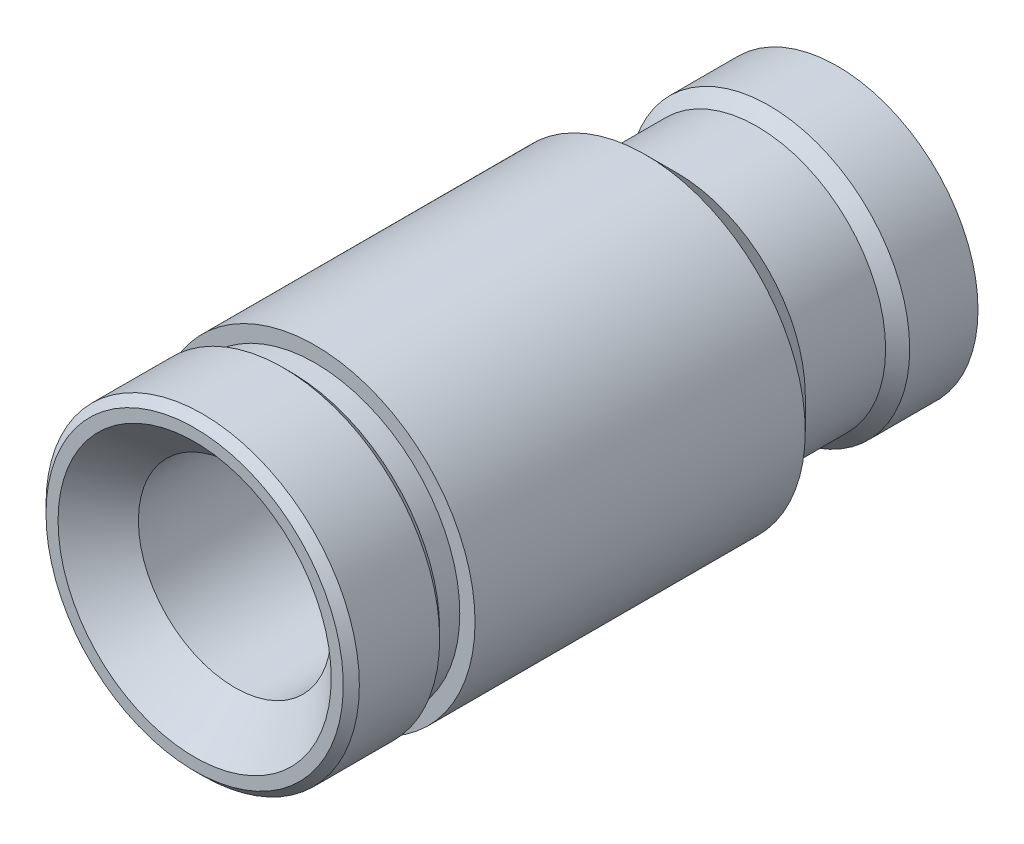
ISO-10303-21;
HEADER;
FILE_DESCRIPTION(('STEP AP214'),'2;1');
FILE_NAME('part.step','',(''),(''),'','','');
FILE_SCHEMA(('AUTOMOTIVE_DESIGN { 1 0 10303 214 1 1 1 1 }'));
ENDSEC;
DATA;
#1=APPLICATION_CONTEXT('core data for automotive mechanical design processes');
#2=APPLICATION_PROTOCOL_DEFINITION('international standard','automotive_design',2000,#1);
#3=PRODUCT_CONTEXT('',#1,'mechanical');
#4=PRODUCT('Part','Part','',(#3));
#5=PRODUCT_RELATED_PRODUCT_CATEGORY('part','',(#4));
#6=PRODUCT_DEFINITION_FORMATION('','',#4);
#7=PRODUCT_DEFINITION_CONTEXT('part definition',#1,'design');
#8=PRODUCT_DEFINITION('design','',#6,#7);
#9=PRODUCT_DEFINITION_SHAPE('','',#8);
#10=(LENGTH_UNIT() NAMED_UNIT(*) SI_UNIT(.MILLI.,.METRE.));
#11=(NAMED_UNIT(*) PLANE_ANGLE_UNIT() SI_UNIT($,.RADIAN.));
#12=(NAMED_UNIT(*) SI_UNIT($,.STERADIAN.) SOLID_ANGLE_UNIT());
#13=UNCERTAINTY_MEASURE_WITH_UNIT(LENGTH_MEASURE(1.E-05),#10,'distance_accuracy_value','');
#14=(GEOMETRIC_REPRESENTATION_CONTEXT(3) GLOBAL_UNCERTAINTY_ASSIGNED_CONTEXT((#13)) GLOBAL_UNIT_ASSIGNED_CONTEXT((#10,
#11,#12)) REPRESENTATION_CONTEXT('',''));
#15=CARTESIAN_POINT('',(0.,0.,0.));
#16=DIRECTION('',(0.,0.,1.));
#17=DIRECTION('',(1.,0.,0.));
#18=AXIS2_PLACEMENT_3D('',#15,#16,#17);
#19=CARTESIAN_POINT('',(0.,0.,0.));
#20=DIRECTION('',(0.,0.,1.));
#21=DIRECTION('',(1.,0.,0.));
#22=AXIS2_PLACEMENT_3D('',#19,#20,#21);
#23=CYLINDRICAL_SURFACE('',#22,19.5);
#24=CARTESIAN_POINT('',(0.,0.,-11.5));
#25=DIRECTION('',(0.,0.,1.));
#26=DIRECTION('',(1.,0.,0.));
#27=AXIS2_PLACEMENT_3D('',#24,#25,#26);
#28=CIRCLE('',#27,19.5);
#29=CARTESIAN_POINT('',(19.5,0.,-11.5));
#30=VERTEX_POINT('',#29);
#31=EDGE_CURVE('E59',#30,#30,#28,.T.);
#32=ORIENTED_EDGE('',*,*,#31,.T.);
#33=EDGE_LOOP('',(#32));
#34=FACE_BOUND('',#33,.T.);
#35=CARTESIAN_POINT('',(0.,0.,-1.5));
#36=DIRECTION('',(0.,0.,-1.));
#37=DIRECTION('',(-1.,0.,0.));
#38=AXIS2_PLACEMENT_3D('',#35,#36,#37);
#39=CIRCLE('',#38,19.5);
#40=CARTESIAN_POINT('',(-19.5,0.,-1.5));
#41=VERTEX_POINT('',#40);
#42=EDGE_CURVE('E62',#41,#41,#39,.T.);
#43=ORIENTED_EDGE('',*,*,#42,.T.);
#44=EDGE_LOOP('',(#43));
#45=FACE_BOUND('',#44,.T.);
#46=ADVANCED_FACE('F33',(#34,#45),#23,.T.);
#47=CARTESIAN_POINT('',(0.,19.5,-12.5));
#48=DIRECTION('',(0.,0.,1.));
#49=DIRECTION('',(1.,0.,0.));
#50=AXIS2_PLACEMENT_3D('',#47,#48,#49);
#51=PLANE('',#50);
#52=CARTESIAN_POINT('',(0.,0.,-12.5));
#53=DIRECTION('',(0.,0.,1.));
#54=DIRECTION('',(1.,0.,0.));
#55=AXIS2_PLACEMENT_3D('',#52,#53,#54);
#56=CIRCLE('',#55,18.5);
#57=CARTESIAN_POINT('',(18.5,0.,-12.5));
#58=VERTEX_POINT('',#57);
#59=EDGE_CURVE('E56',#58,#58,#56,.F.);
#60=ORIENTED_EDGE('',*,*,#59,.T.);
#61=EDGE_LOOP('',(#60));
#62=FACE_BOUND('',#61,.T.);
#63=CARTESIAN_POINT('',(0.,0.,-12.5));
#64=DIRECTION('',(0.,0.,1.));
#65=DIRECTION('',(1.,0.,0.));
#66=AXIS2_PLACEMENT_3D('',#63,#64,#65);
#67=CIRCLE('',#66,18.);
#68=CARTESIAN_POINT('',(18.,0.,-12.5));
#69=VERTEX_POINT('',#68);
#70=EDGE_CURVE('E65',#69,#69,#67,.T.);
#71=ORIENTED_EDGE('',*,*,#70,.T.);
#72=EDGE_LOOP('',(#71));
#73=FACE_BOUND('',#72,.T.);
#74=ADVANCED_FACE('F112',(#62,#73),#51,.F.);
#75=CARTESIAN_POINT('',(0.,0.,0.));
#76=DIRECTION('',(0.,0.,1.));
#77=DIRECTION('',(1.,0.,0.));
#78=AXIS2_PLACEMENT_3D('',#75,#76,#77);
#79=CYLINDRICAL_SURFACE('',#78,18.);
#80=ORIENTED_EDGE('',*,*,#70,.F.);
#81=EDGE_LOOP('',(#80));
#82=FACE_BOUND('',#81,.T.);
#83=CARTESIAN_POINT('',(0.,0.,-15.5));
#84=DIRECTION('',(0.,0.,1.));
#85=DIRECTION('',(1.,0.,0.));
#86=AXIS2_PLACEMENT_3D('',#83,#84,#85);
#87=CIRCLE('',#86,18.);
#88=CARTESIAN_POINT('',(18.,0.,-15.5));
#89=VERTEX_POINT('',#88);
#90=EDGE_CURVE('E68',#89,#89,#87,.T.);
#91=ORIENTED_EDGE('',*,*,#90,.T.);
#92=EDGE_LOOP('',(#91));
#93=FACE_BOUND('',#92,.T.);
#94=ADVANCED_FACE('F118',(#82,#93),#79,.T.);
#95=CARTESIAN_POINT('',(0.,18.,-15.5));
#96=DIRECTION('',(0.,0.,-1.));
#97=DIRECTION('',(-1.,0.,0.));
#98=AXIS2_PLACEMENT_3D('',#95,#96,#97);
#99=PLANE('',#98);
#100=ORIENTED_EDGE('',*,*,#90,.F.);
#101=EDGE_LOOP('',(#100));
#102=FACE_BOUND('',#101,.T.);
#103=CARTESIAN_POINT('',(0.,0.,-15.5));
#104=DIRECTION('',(0.,0.,1.));
#105=DIRECTION('',(1.,0.,0.));
#106=AXIS2_PLACEMENT_3D('',#103,#104,#105);
#107=CIRCLE('',#106,19.9);
#108=CARTESIAN_POINT('',(19.9,0.,-15.5));
#109=VERTEX_POINT('',#108);
#110=EDGE_CURVE('E71',#109,#109,#107,.T.);
#111=ORIENTED_EDGE('',*,*,#110,.T.);
#112=EDGE_LOOP('',(#111));
#113=FACE_BOUND('',#112,.T.);
#114=ADVANCED_FACE('F171',(#102,#113),#99,.F.);
#115=CARTESIAN_POINT('',(0.,0.,0.));
#116=DIRECTION('',(0.,0.,1.));
#117=DIRECTION('',(1.,0.,0.));
#118=AXIS2_PLACEMENT_3D('',#115,#116,#117);
#119=CYLINDRICAL_SURFACE('',#118,19.9);
#120=ORIENTED_EDGE('',*,*,#110,.F.);
#121=EDGE_LOOP('',(#120));
#122=FACE_BOUND('',#121,.T.);
#123=CARTESIAN_POINT('',(0.,0.,-56.6));
#124=DIRECTION('',(0.,0.,1.));
#125=DIRECTION('',(1.,0.,0.));
#126=AXIS2_PLACEMENT_3D('',#123,#124,#125);
#127=CIRCLE('',#126,19.9);
#128=CARTESIAN_POINT('',(19.9,0.,-56.6));
#129=VERTEX_POINT('',#128);
#130=EDGE_CURVE('E74',#129,#129,#127,.T.);
#131=ORIENTED_EDGE('',*,*,#130,.T.);
#132=EDGE_LOOP('',(#131));
#133=FACE_BOUND('',#132,.T.);
#134=ADVANCED_FACE('F167',(#122,#133),#119,.T.);
#135=CARTESIAN_POINT('',(0.,0.,-60.5));
#136=DIRECTION('',(0.,0.,1.));
#137=DIRECTION('',(1.,0.,0.));
#138=AXIS2_PLACEMENT_3D('',#135,#136,#137);
#139=CONICAL_SURFACE('',#138,16.,0.785398163397443);
#140=ORIENTED_EDGE('',*,*,#130,.F.);
#141=EDGE_LOOP('',(#140));
#142=FACE_BOUND('',#141,.T.);
#143=CARTESIAN_POINT('',(0.,0.,-60.5));
#144=DIRECTION('',(0.,0.,1.));
#145=DIRECTION('',(1.,0.,0.));
#146=AXIS2_PLACEMENT_3D('',#143,#144,#145);
#147=CIRCLE('',#146,16.);
#148=CARTESIAN_POINT('',(16.,0.,-60.5));
#149=VERTEX_POINT('',#148);
#150=EDGE_CURVE('E77',#149,#149,#147,.T.);
#151=ORIENTED_EDGE('',*,*,#150,.T.);
#152=EDGE_LOOP('',(#151));
#153=FACE_BOUND('',#152,.T.);
#154=ADVANCED_FACE('F163',(#142,#153),#139,.T.);
#155=CARTESIAN_POINT('',(0.,0.,0.));
#156=DIRECTION('',(0.,0.,1.));
#157=DIRECTION('',(1.,0.,0.));
#158=AXIS2_PLACEMENT_3D('',#155,#156,#157);
#159=CYLINDRICAL_SURFACE('',#158,16.);
#160=ORIENTED_EDGE('',*,*,#150,.F.);
#161=EDGE_LOOP('',(#160));
#162=FACE_BOUND('',#161,.T.);
#163=CARTESIAN_POINT('',(0.,0.,-70.5));
#164=DIRECTION('',(0.,0.,1.));
#165=DIRECTION('',(1.,0.,0.));
#166=AXIS2_PLACEMENT_3D('',#163,#164,#165);
#167=CIRCLE('',#166,16.);
#168=CARTESIAN_POINT('',(16.,0.,-70.5));
#169=VERTEX_POINT('',#168);
#170=EDGE_CURVE('E80',#169,#169,#167,.T.);
#171=ORIENTED_EDGE('',*,*,#170,.T.);
#172=EDGE_LOOP('',(#171));
#173=FACE_BOUND('',#172,.T.);
#174=ADVANCED_FACE('F155',(#162,#173),#159,.T.);
#175=CARTESIAN_POINT('',(0.,0.,-72.));
#176=DIRECTION('',(0.,0.,-1.));
#177=DIRECTION('',(-1.,0.,0.));
#178=AXIS2_PLACEMENT_3D('',#175,#176,#177);
#179=CONICAL_SURFACE('',#178,17.5,0.785398163397453);
#180=ORIENTED_EDGE('',*,*,#170,.F.);
#181=EDGE_LOOP('',(#180));
#182=FACE_BOUND('',#181,.T.);
#183=CARTESIAN_POINT('',(0.,0.,-72.));
#184=DIRECTION('',(0.,0.,1.));
#185=DIRECTION('',(1.,0.,0.));
#186=AXIS2_PLACEMENT_3D('',#183,#184,#185);
#187=CIRCLE('',#186,17.5);
#188=CARTESIAN_POINT('',(17.5,0.,-72.));
#189=VERTEX_POINT('',#188);
#190=EDGE_CURVE('E83',#189,#189,#187,.T.);
#191=ORIENTED_EDGE('',*,*,#190,.T.);
#192=EDGE_LOOP('',(#191));
#193=FACE_BOUND('',#192,.T.);
#194=ADVANCED_FACE('F149',(#182,#193),#179,.T.);
#195=CARTESIAN_POINT('',(0.,0.,0.));
#196=DIRECTION('',(0.,0.,1.));
#197=DIRECTION('',(1.,0.,0.));
#198=AXIS2_PLACEMENT_3D('',#195,#196,#197);
#199=CYLINDRICAL_SURFACE('',#198,17.5);
#200=ORIENTED_EDGE('',*,*,#190,.F.);
#201=EDGE_LOOP('',(#200));
#202=FACE_BOUND('',#201,.T.);
#203=CARTESIAN_POINT('',(0.,0.,-80.5));
#204=DIRECTION('',(0.,0.,1.));
#205=DIRECTION('',(1.,0.,0.));
#206=AXIS2_PLACEMENT_3D('',#203,#204,#205);
#207=CIRCLE('',#206,17.5);
#208=CARTESIAN_POINT('',(17.5,0.,-80.5));
#209=VERTEX_POINT('',#208);
#210=EDGE_CURVE('E86',#209,#209,#207,.T.);
#211=ORIENTED_EDGE('',*,*,#210,.T.);
#212=EDGE_LOOP('',(#211));
#213=FACE_BOUND('',#212,.T.);
#214=ADVANCED_FACE('F144',(#202,#213),#199,.T.);
#215=CARTESIAN_POINT('',(0.,11.,-80.5));
#216=DIRECTION('',(0.,0.,1.));
#217=DIRECTION('',(1.,0.,0.));
#218=AXIS2_PLACEMENT_3D('',#215,#216,#217);
#219=PLANE('',#218);
#220=CARTESIAN_POINT('',(0.,0.,-80.5));
#221=DIRECTION('',(0.,0.,1.));
#222=DIRECTION('',(1.,0.,0.));
#223=AXIS2_PLACEMENT_3D('',#220,#221,#222);
#224=CIRCLE('',#223,13.);
#225=CARTESIAN_POINT('',(13.,0.,-80.5));
#226=VERTEX_POINT('',#225);
#227=EDGE_CURVE('E48',#226,#226,#224,.T.);
#228=ORIENTED_EDGE('',*,*,#227,.T.);
#229=EDGE_LOOP('',(#228));
#230=FACE_BOUND('',#229,.T.);
#231=ORIENTED_EDGE('',*,*,#210,.F.);
#232=EDGE_LOOP('',(#231));
#233=FACE_BOUND('',#232,.T.);
#234=ADVANCED_FACE('F141',(#230,#233),#219,.F.);
#235=CARTESIAN_POINT('',(0.,0.,0.));
#236=DIRECTION('',(0.,0.,1.));
#237=DIRECTION('',(1.,0.,0.));
#238=AXIS2_PLACEMENT_3D('',#235,#236,#237);
#239=CYLINDRICAL_SURFACE('',#238,11.);
#240=CARTESIAN_POINT('',(0.,0.,-78.5));
#241=DIRECTION('',(0.,0.,1.));
#242=DIRECTION('',(1.,0.,0.));
#243=AXIS2_PLACEMENT_3D('',#240,#241,#242);
#244=CIRCLE('',#243,11.);
#245=CARTESIAN_POINT('',(11.,0.,-78.5));
#246=VERTEX_POINT('',#245);
#247=EDGE_CURVE('E44',#246,#246,#244,.F.);
#248=ORIENTED_EDGE('',*,*,#247,.T.);
#249=EDGE_LOOP('',(#248));
#250=FACE_BOUND('',#249,.T.);
#251=CARTESIAN_POINT('',(0.,0.,-63.5));
#252=DIRECTION('',(0.,0.,1.));
#253=DIRECTION('',(1.,0.,0.));
#254=AXIS2_PLACEMENT_3D('',#251,#252,#253);
#255=CIRCLE('',#254,11.);
#256=CARTESIAN_POINT('',(11.,0.,-63.5));
#257=VERTEX_POINT('',#256);
#258=EDGE_CURVE('E89',#257,#257,#255,.T.);
#259=ORIENTED_EDGE('',*,*,#258,.T.);
#260=EDGE_LOOP('',(#259));
#261=FACE_BOUND('',#260,.T.);
#262=ADVANCED_FACE('F108',(#250,#261),#239,.F.);
#263=CARTESIAN_POINT('',(0.,12.,-63.5));
#264=DIRECTION('',(0.,0.,-1.));
#265=DIRECTION('',(-1.,0.,0.));
#266=AXIS2_PLACEMENT_3D('',#263,#264,#265);
#267=PLANE('',#266);
#268=ORIENTED_EDGE('',*,*,#258,.F.);
#269=EDGE_LOOP('',(#268));
#270=FACE_BOUND('',#269,.T.);
#271=CARTESIAN_POINT('',(0.,0.,-63.5));
#272=DIRECTION('',(0.,0.,1.));
#273=DIRECTION('',(1.,0.,0.));
#274=AXIS2_PLACEMENT_3D('',#271,#272,#273);
#275=CIRCLE('',#274,12.);
#276=CARTESIAN_POINT('',(12.,0.,-63.5));
#277=VERTEX_POINT('',#276);
#278=EDGE_CURVE('E92',#277,#277,#275,.T.);
#279=ORIENTED_EDGE('',*,*,#278,.T.);
#280=EDGE_LOOP('',(#279));
#281=FACE_BOUND('',#280,.T.);
#282=ADVANCED_FACE('F96',(#270,#281),#267,.F.);
#283=CARTESIAN_POINT('',(0.,0.,0.));
#284=DIRECTION('',(0.,0.,1.));
#285=DIRECTION('',(1.,0.,0.));
#286=AXIS2_PLACEMENT_3D('',#283,#284,#285);
#287=CYLINDRICAL_SURFACE('',#286,12.);
#288=CARTESIAN_POINT('',(0.,0.,-5.49999999999999));
#289=DIRECTION('',(0.,0.,-1.));
#290=DIRECTION('',(-1.,0.,0.));
#291=AXIS2_PLACEMENT_3D('',#288,#289,#290);
#292=CIRCLE('',#291,12.);
#293=CARTESIAN_POINT('',(-12.,0.,-5.49999999999999));
#294=VERTEX_POINT('',#293);
#295=EDGE_CURVE('E40',#294,#294,#292,.F.);
#296=ORIENTED_EDGE('',*,*,#295,.T.);
#297=EDGE_LOOP('',(#296));
#298=FACE_BOUND('',#297,.T.);
#299=ORIENTED_EDGE('',*,*,#278,.F.);
#300=EDGE_LOOP('',(#299));
#301=FACE_BOUND('',#300,.T.);
#302=ADVANCED_FACE('F98',(#298,#301),#287,.F.);
#303=CARTESIAN_POINT('',(0.,12.,-0.500000000000001));
#304=DIRECTION('',(0.,0.,-1.));
#305=DIRECTION('',(-1.,0.,0.));
#306=AXIS2_PLACEMENT_3D('',#303,#304,#305);
#307=PLANE('',#306);
#308=CARTESIAN_POINT('',(0.,0.,-0.500000000000001));
#309=DIRECTION('',(0.,0.,-1.));
#310=DIRECTION('',(-1.,0.,0.));
#311=AXIS2_PLACEMENT_3D('',#308,#309,#310);
#312=CIRCLE('',#311,17.);
#313=CARTESIAN_POINT('',(-17.,0.,-0.500000000000001));
#314=VERTEX_POINT('',#313);
#315=EDGE_CURVE('E10',#314,#314,#312,.T.);
#316=ORIENTED_EDGE('',*,*,#315,.T.);
#317=EDGE_LOOP('',(#316));
#318=FACE_BOUND('',#317,.T.);
#319=CARTESIAN_POINT('',(0.,0.,-0.500000000000001));
#320=DIRECTION('',(0.,0.,-1.));
#321=DIRECTION('',(-1.,0.,0.));
#322=AXIS2_PLACEMENT_3D('',#319,#320,#321);
#323=CIRCLE('',#322,18.5);
#324=CARTESIAN_POINT('',(-18.5,0.,-0.500000000000001));
#325=VERTEX_POINT('',#324);
#326=EDGE_CURVE('E53',#325,#325,#323,.F.);
#327=ORIENTED_EDGE('',*,*,#326,.T.);
#328=EDGE_LOOP('',(#327));
#329=FACE_BOUND('',#328,.T.);
#330=ADVANCED_FACE('F100',(#318,#329),#307,.F.);
#331=CARTESIAN_POINT('',(0.,0.,-11.5));
#332=DIRECTION('',(0.,0.,1.));
#333=DIRECTION('',(1.,0.,0.));
#334=AXIS2_PLACEMENT_3D('',#331,#332,#333);
#335=CONICAL_SURFACE('',#334,19.5,0.78539816339745);
#336=ORIENTED_EDGE('',*,*,#59,.F.);
#337=EDGE_LOOP('',(#336));
#338=FACE_BOUND('',#337,.T.);
#339=ORIENTED_EDGE('',*,*,#31,.F.);
#340=EDGE_LOOP('',(#339));
#341=FACE_BOUND('',#340,.T.);
#342=ADVANCED_FACE('F106',(#338,#341),#335,.T.);
#343=CARTESIAN_POINT('',(0.,0.,-0.500000000000001));
#344=DIRECTION('',(0.,0.,-1.));
#345=DIRECTION('',(-1.,0.,0.));
#346=AXIS2_PLACEMENT_3D('',#343,#344,#345);
#347=CONICAL_SURFACE('',#346,18.5,0.785398163397457);
#348=ORIENTED_EDGE('',*,*,#42,.F.);
#349=EDGE_LOOP('',(#348));
#350=FACE_BOUND('',#349,.T.);
#351=ORIENTED_EDGE('',*,*,#326,.F.);
#352=EDGE_LOOP('',(#351));
#353=FACE_BOUND('',#352,.T.);
#354=ADVANCED_FACE('F126',(#350,#353),#347,.T.);
#355=CARTESIAN_POINT('',(0.,0.,-80.5));
#356=DIRECTION('',(0.,0.,-1.));
#357=DIRECTION('',(-1.,0.,0.));
#358=AXIS2_PLACEMENT_3D('',#355,#356,#357);
#359=CONICAL_SURFACE('',#358,13.,0.785398163397446);
#360=ORIENTED_EDGE('',*,*,#247,.F.);
#361=EDGE_LOOP('',(#360));
#362=FACE_BOUND('',#361,.T.);
#363=ORIENTED_EDGE('',*,*,#227,.F.);
#364=EDGE_LOOP('',(#363));
#365=FACE_BOUND('',#364,.T.);
#366=ADVANCED_FACE('F129',(#362,#365),#359,.F.);
#367=CARTESIAN_POINT('',(0.,0.,-5.49999999999999));
#368=DIRECTION('',(0.,0.,1.));
#369=DIRECTION('',(1.,0.,0.));
#370=AXIS2_PLACEMENT_3D('',#367,#368,#369);
#371=CONICAL_SURFACE('',#370,12.,0.78539816339745);
#372=ORIENTED_EDGE('',*,*,#315,.F.);
#373=EDGE_LOOP('',(#372));
#374=FACE_BOUND('',#373,.T.);
#375=ORIENTED_EDGE('',*,*,#295,.F.);
#376=EDGE_LOOP('',(#375));
#377=FACE_BOUND('',#376,.T.);
#378=ADVANCED_FACE('F35',(#374,#377),#371,.F.);
#379=CLOSED_SHELL('',(#46,#74,#94,#114,#134,#154,#174,#194,#214,#234,#262,#282,#302,#330,#342,
#354,#366,#378));
#380=MANIFOLD_SOLID_BREP('B2',#379);
#381=ADVANCED_BREP_SHAPE_REPRESENTATION('',(#18,#380),#14);
#382=SHAPE_DEFINITION_REPRESENTATION(#9,#381);
ENDSEC;
END-ISO-10303-21;
